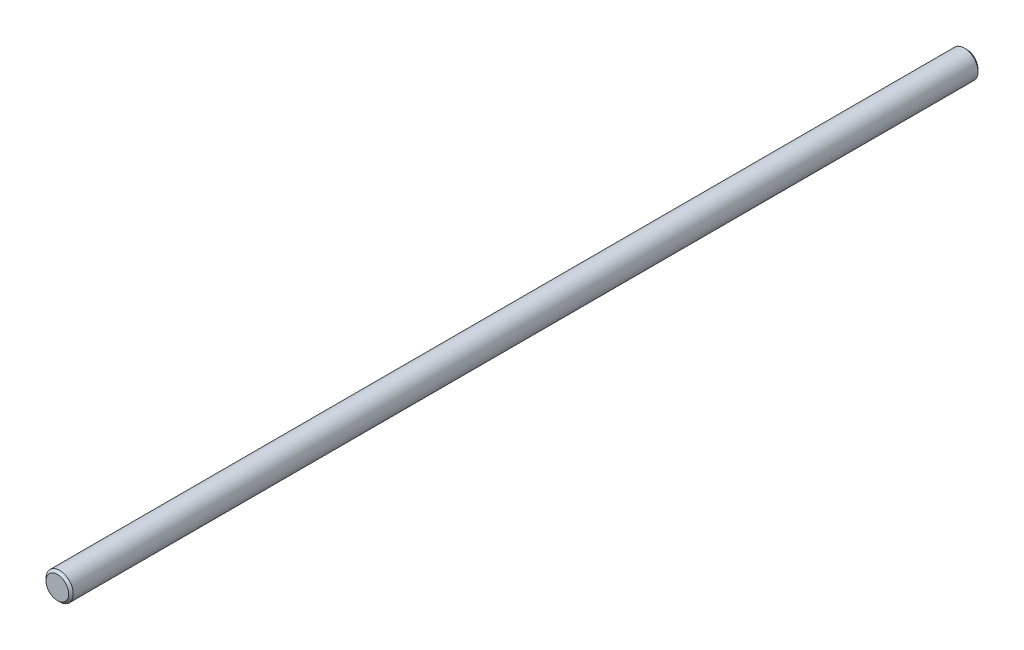
ISO-10303-21;
HEADER;
FILE_DESCRIPTION(('STEP AP214'),'2;1');
FILE_NAME('part.step','',(''),(''),'','','');
FILE_SCHEMA(('AUTOMOTIVE_DESIGN { 1 0 10303 214 1 1 1 1 }'));
ENDSEC;
DATA;
#1=APPLICATION_CONTEXT('core data for automotive mechanical design processes');
#2=APPLICATION_PROTOCOL_DEFINITION('international standard','automotive_design',2000,#1);
#3=PRODUCT_CONTEXT('',#1,'mechanical');
#4=PRODUCT('Part','Part','',(#3));
#5=PRODUCT_RELATED_PRODUCT_CATEGORY('part','',(#4));
#6=PRODUCT_DEFINITION_FORMATION('','',#4);
#7=PRODUCT_DEFINITION_CONTEXT('part definition',#1,'design');
#8=PRODUCT_DEFINITION('design','',#6,#7);
#9=PRODUCT_DEFINITION_SHAPE('','',#8);
#10=(LENGTH_UNIT() NAMED_UNIT(*) SI_UNIT(.MILLI.,.METRE.));
#11=(NAMED_UNIT(*) PLANE_ANGLE_UNIT() SI_UNIT($,.RADIAN.));
#12=(NAMED_UNIT(*) SI_UNIT($,.STERADIAN.) SOLID_ANGLE_UNIT());
#13=UNCERTAINTY_MEASURE_WITH_UNIT(LENGTH_MEASURE(1.E-05),#10,'distance_accuracy_value','');
#14=(GEOMETRIC_REPRESENTATION_CONTEXT(3) GLOBAL_UNCERTAINTY_ASSIGNED_CONTEXT((#13)) GLOBAL_UNIT_ASSIGNED_CONTEXT((#10,
#11,#12)) REPRESENTATION_CONTEXT('',''));
#15=CARTESIAN_POINT('',(0.,0.,0.));
#16=DIRECTION('',(0.,0.,1.));
#17=DIRECTION('',(1.,0.,0.));
#18=AXIS2_PLACEMENT_3D('',#15,#16,#17);
#19=CARTESIAN_POINT('',(0.,0.,400.));
#20=DIRECTION('',(0.,0.,-1.));
#21=DIRECTION('',(-1.,0.,0.));
#22=AXIS2_PLACEMENT_3D('',#19,#20,#21);
#23=CYLINDRICAL_SURFACE('',#22,6.);
#24=CARTESIAN_POINT('',(0.,0.,0.999999999999945));
#25=DIRECTION('',(0.,0.,1.));
#26=DIRECTION('',(1.,0.,0.));
#27=AXIS2_PLACEMENT_3D('',#24,#25,#26);
#28=CIRCLE('',#27,6.);
#29=CARTESIAN_POINT('',(6.,0.,0.999999999999945));
#30=VERTEX_POINT('',#29);
#31=EDGE_CURVE('E58',#30,#30,#28,.T.);
#32=ORIENTED_EDGE('',*,*,#31,.T.);
#33=EDGE_LOOP('',(#32));
#34=FACE_BOUND('',#33,.T.);
#35=CARTESIAN_POINT('',(0.,0.,399.));
#36=DIRECTION('',(0.,0.,1.));
#37=DIRECTION('',(1.,0.,0.));
#38=AXIS2_PLACEMENT_3D('',#35,#36,#37);
#39=CIRCLE('',#38,6.);
#40=CARTESIAN_POINT('',(6.,0.,399.));
#41=VERTEX_POINT('',#40);
#42=EDGE_CURVE('E62',#41,#41,#39,.F.);
#43=ORIENTED_EDGE('',*,*,#42,.T.);
#44=EDGE_LOOP('',(#43));
#45=FACE_BOUND('',#44,.T.);
#46=ADVANCED_FACE('F47',(#34,#45),#23,.T.);
#47=CARTESIAN_POINT('',(0.,0.,400.));
#48=DIRECTION('',(0.,0.,1.));
#49=DIRECTION('',(1.,0.,0.));
#50=AXIS2_PLACEMENT_3D('',#47,#48,#49);
#51=PLANE('',#50);
#52=CARTESIAN_POINT('',(0.,0.,400.));
#53=DIRECTION('',(0.,0.,1.));
#54=DIRECTION('',(1.,0.,0.));
#55=AXIS2_PLACEMENT_3D('',#52,#53,#54);
#56=CIRCLE('',#55,5.00000000000012);
#57=CARTESIAN_POINT('',(5.00000000000012,0.,400.));
#58=VERTEX_POINT('',#57);
#59=EDGE_CURVE('E12',#58,#58,#56,.T.);
#60=ORIENTED_EDGE('',*,*,#59,.T.);
#61=EDGE_LOOP('',(#60));
#62=FACE_BOUND('',#61,.T.);
#63=ADVANCED_FACE('F78',(#62),#51,.T.);
#64=CARTESIAN_POINT('',(0.,0.,0.));
#65=DIRECTION('',(0.,0.,1.));
#66=DIRECTION('',(1.,0.,0.));
#67=AXIS2_PLACEMENT_3D('',#64,#65,#66);
#68=PLANE('',#67);
#69=CARTESIAN_POINT('',(0.,0.,0.));
#70=DIRECTION('',(0.,0.,1.));
#71=DIRECTION('',(1.,0.,0.));
#72=AXIS2_PLACEMENT_3D('',#69,#70,#71);
#73=CIRCLE('',#72,5.00000000000006);
#74=CARTESIAN_POINT('',(5.00000000000006,0.,0.));
#75=VERTEX_POINT('',#74);
#76=EDGE_CURVE('E54',#75,#75,#73,.F.);
#77=ORIENTED_EDGE('',*,*,#76,.T.);
#78=EDGE_LOOP('',(#77));
#79=FACE_BOUND('',#78,.T.);
#80=ADVANCED_FACE('F75',(#79),#68,.F.);
#81=CARTESIAN_POINT('',(0.,0.,0.999999999999945));
#82=DIRECTION('',(0.,0.,1.));
#83=DIRECTION('',(1.,0.,0.));
#84=AXIS2_PLACEMENT_3D('',#81,#82,#83);
#85=CONICAL_SURFACE('',#84,6.,0.785398163397445);
#86=ORIENTED_EDGE('',*,*,#76,.F.);
#87=EDGE_LOOP('',(#86));
#88=FACE_BOUND('',#87,.T.);
#89=ORIENTED_EDGE('',*,*,#31,.F.);
#90=EDGE_LOOP('',(#89));
#91=FACE_BOUND('',#90,.T.);
#92=ADVANCED_FACE('F71',(#88,#91),#85,.T.);
#93=CARTESIAN_POINT('',(0.,0.,400.));
#94=DIRECTION('',(0.,0.,-1.));
#95=DIRECTION('',(-1.,0.,0.));
#96=AXIS2_PLACEMENT_3D('',#93,#94,#95);
#97=CONICAL_SURFACE('',#96,5.00000000000012,0.785398163397445);
#98=ORIENTED_EDGE('',*,*,#42,.F.);
#99=EDGE_LOOP('',(#98));
#100=FACE_BOUND('',#99,.T.);
#101=ORIENTED_EDGE('',*,*,#59,.F.);
#102=EDGE_LOOP('',(#101));
#103=FACE_BOUND('',#102,.T.);
#104=ADVANCED_FACE('F49',(#100,#103),#97,.T.);
#105=CLOSED_SHELL('',(#46,#63,#80,#92,#104));
#106=MANIFOLD_SOLID_BREP('B2',#105);
#107=ADVANCED_BREP_SHAPE_REPRESENTATION('',(#18,#106),#14);
#108=SHAPE_DEFINITION_REPRESENTATION(#9,#107);
ENDSEC;
END-ISO-10303-21;
